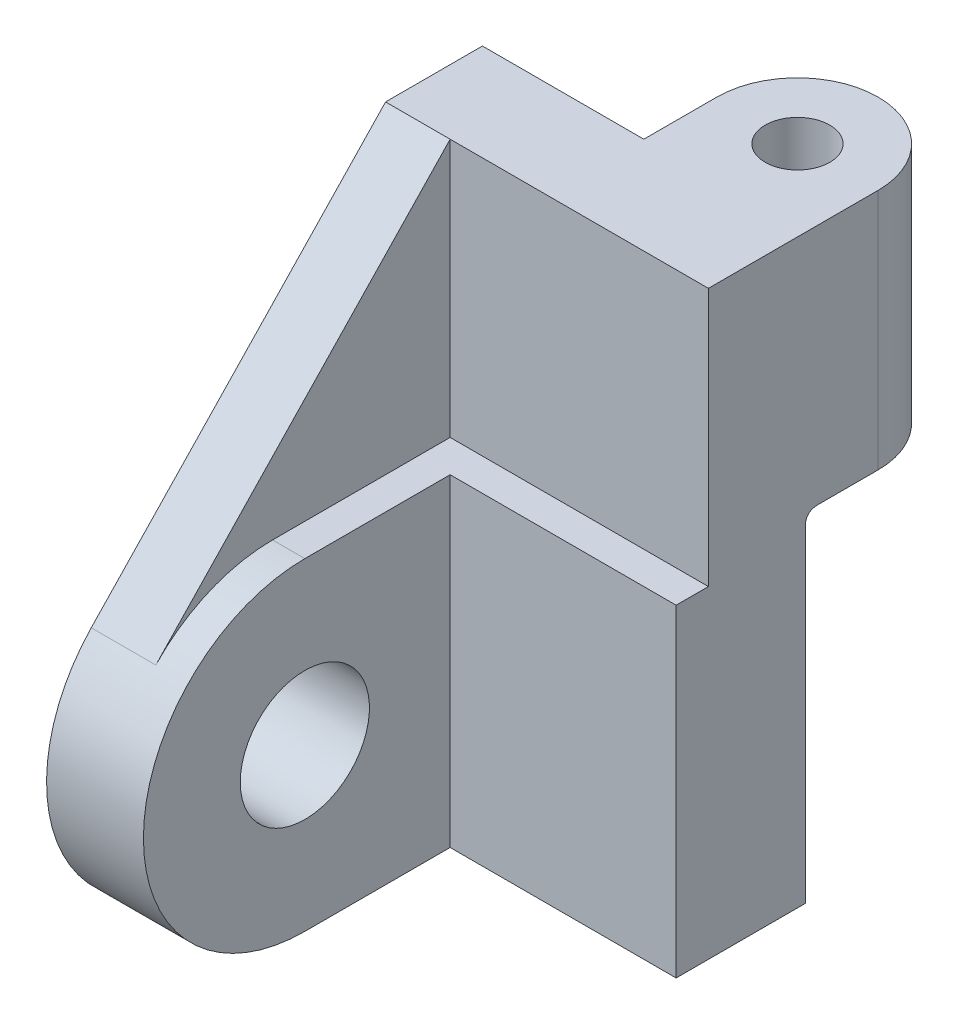
ISO-10303-21;
HEADER;
FILE_DESCRIPTION(('STEP AP214'),'2;1');
FILE_NAME('part.step','',(''),(''),'','','');
FILE_SCHEMA(('AUTOMOTIVE_DESIGN { 1 0 10303 214 1 1 1 1 }'));
ENDSEC;
DATA;
#1=APPLICATION_CONTEXT('core data for automotive mechanical design processes');
#2=APPLICATION_PROTOCOL_DEFINITION('international standard','automotive_design',2000,#1);
#3=PRODUCT_CONTEXT('',#1,'mechanical');
#4=PRODUCT('Part','Part','',(#3));
#5=PRODUCT_RELATED_PRODUCT_CATEGORY('part','',(#4));
#6=PRODUCT_DEFINITION_FORMATION('','',#4);
#7=PRODUCT_DEFINITION_CONTEXT('part definition',#1,'design');
#8=PRODUCT_DEFINITION('design','',#6,#7);
#9=PRODUCT_DEFINITION_SHAPE('','',#8);
#10=(LENGTH_UNIT() NAMED_UNIT(*) SI_UNIT(.MILLI.,.METRE.));
#11=(NAMED_UNIT(*) PLANE_ANGLE_UNIT() SI_UNIT($,.RADIAN.));
#12=(NAMED_UNIT(*) SI_UNIT($,.STERADIAN.) SOLID_ANGLE_UNIT());
#13=UNCERTAINTY_MEASURE_WITH_UNIT(LENGTH_MEASURE(1.E-05),#10,'distance_accuracy_value','');
#14=(GEOMETRIC_REPRESENTATION_CONTEXT(3) GLOBAL_UNCERTAINTY_ASSIGNED_CONTEXT((#13)) GLOBAL_UNIT_ASSIGNED_CONTEXT((#10,
#11,#12)) REPRESENTATION_CONTEXT('',''));
#15=CARTESIAN_POINT('',(0.,0.,0.));
#16=DIRECTION('',(0.,0.,1.));
#17=DIRECTION('',(1.,0.,0.));
#18=AXIS2_PLACEMENT_3D('',#15,#16,#17);
#19=CARTESIAN_POINT('',(63.5,114.3,0.));
#20=DIRECTION('',(0.,1.,0.));
#21=DIRECTION('',(0.,0.,1.));
#22=AXIS2_PLACEMENT_3D('',#19,#20,#21);
#23=PLANE('',#22);
#24=CARTESIAN_POINT('',(47.625,114.3,-14.3417082606849));
#25=DIRECTION('',(0.,1.,0.));
#26=DIRECTION('',(0.,0.,1.));
#27=AXIS2_PLACEMENT_3D('',#24,#25,#26);
#28=CIRCLE('',#27,6.35);
#29=CARTESIAN_POINT('',(47.625,114.3,-7.99170826068487));
#30=VERTEX_POINT('',#29);
#31=EDGE_CURVE('E225',#30,#30,#28,.T.);
#32=ORIENTED_EDGE('',*,*,#31,.F.);
#33=EDGE_LOOP('',(#32));
#34=FACE_BOUND('',#33,.T.);
#35=DIRECTION('',(0.,0.,-1.));
#36=VECTOR('',#35,1.);
#37=CARTESIAN_POINT('',(63.5,114.3,0.));
#38=LINE('',#37,#36);
#39=CARTESIAN_POINT('',(63.5,114.3,19.05));
#40=VERTEX_POINT('',#39);
#41=CARTESIAN_POINT('',(63.5,114.3,-14.3417082606849));
#42=VERTEX_POINT('',#41);
#43=EDGE_CURVE('E176',#40,#42,#38,.T.);
#44=ORIENTED_EDGE('',*,*,#43,.T.);
#45=CARTESIAN_POINT('',(47.625,114.3,-14.3417082606849));
#46=DIRECTION('',(0.,1.,0.));
#47=DIRECTION('',(0.,0.,1.));
#48=AXIS2_PLACEMENT_3D('',#45,#46,#47);
#49=CIRCLE('',#48,15.875);
#50=CARTESIAN_POINT('',(31.75,114.3,-14.3417082606849));
#51=VERTEX_POINT('',#50);
#52=EDGE_CURVE('E159',#42,#51,#49,.T.);
#53=ORIENTED_EDGE('',*,*,#52,.T.);
#54=DIRECTION('',(0.,0.,1.));
#55=VECTOR('',#54,1.);
#56=CARTESIAN_POINT('',(31.75,114.3,-31.75));
#57=LINE('',#56,#55);
#58=CARTESIAN_POINT('',(31.75,114.3,0.));
#59=VERTEX_POINT('',#58);
#60=EDGE_CURVE('E222',#51,#59,#57,.T.);
#61=ORIENTED_EDGE('',*,*,#60,.T.);
#62=DIRECTION('',(-1.,0.,0.));
#63=VECTOR('',#62,1.);
#64=CARTESIAN_POINT('',(63.5,114.3,0.));
#65=LINE('',#64,#63);
#66=CARTESIAN_POINT('',(0.,114.3,0.));
#67=VERTEX_POINT('',#66);
#68=EDGE_CURVE('E185',#59,#67,#65,.T.);
#69=ORIENTED_EDGE('',*,*,#68,.T.);
#70=DIRECTION('',(0.,0.,-1.));
#71=VECTOR('',#70,1.);
#72=CARTESIAN_POINT('',(0.,114.3,0.));
#73=LINE('',#72,#71);
#74=CARTESIAN_POINT('',(0.,114.3,19.05));
#75=VERTEX_POINT('',#74);
#76=EDGE_CURVE('E200',#75,#67,#73,.T.);
#77=ORIENTED_EDGE('',*,*,#76,.F.);
#78=DIRECTION('',(-1.,0.,0.));
#79=VECTOR('',#78,1.);
#80=CARTESIAN_POINT('',(12.7,114.3,19.05));
#81=LINE('',#80,#79);
#82=CARTESIAN_POINT('',(12.7,114.3,19.05));
#83=VERTEX_POINT('',#82);
#84=EDGE_CURVE('E251',#83,#75,#81,.T.);
#85=ORIENTED_EDGE('',*,*,#84,.F.);
#86=DIRECTION('',(-1.,0.,0.));
#87=VECTOR('',#86,1.);
#88=CARTESIAN_POINT('',(63.5,114.3,19.05));
#89=LINE('',#88,#87);
#90=EDGE_CURVE('E181',#40,#83,#89,.T.);
#91=ORIENTED_EDGE('',*,*,#90,.F.);
#92=EDGE_LOOP('',(#44,#53,#61,#69,#77,#85,#91));
#93=FACE_BOUND('',#92,.T.);
#94=ADVANCED_FACE('F55',(#34,#93),#23,.T.);
#95=CARTESIAN_POINT('',(63.5,0.,0.));
#96=DIRECTION('',(1.,0.,0.));
#97=DIRECTION('',(0.,0.,-1.));
#98=AXIS2_PLACEMENT_3D('',#95,#96,#97);
#99=PLANE('',#98);
#100=DIRECTION('',(0.,0.,1.));
#101=VECTOR('',#100,1.);
#102=CARTESIAN_POINT('',(63.5,66.675,-31.75));
#103=LINE('',#102,#101);
#104=CARTESIAN_POINT('',(63.5,66.675,-14.3417082606849));
#105=VERTEX_POINT('',#104);
#106=CARTESIAN_POINT('',(63.5,66.675,-2.54));
#107=VERTEX_POINT('',#106);
#108=EDGE_CURVE('E178',#105,#107,#103,.T.);
#109=ORIENTED_EDGE('',*,*,#108,.F.);
#110=DIRECTION('',(0.,1.,0.));
#111=VECTOR('',#110,1.);
#112=CARTESIAN_POINT('',(63.5,-5.00000000014378E-05,-14.3417082606849));
#113=LINE('',#112,#111);
#114=EDGE_CURVE('E162',#105,#42,#113,.T.);
#115=ORIENTED_EDGE('',*,*,#114,.T.);
#116=ORIENTED_EDGE('',*,*,#43,.F.);
#117=DIRECTION('',(0.,1.,0.));
#118=VECTOR('',#117,1.);
#119=CARTESIAN_POINT('',(63.5,0.,19.05));
#120=LINE('',#119,#118);
#121=CARTESIAN_POINT('',(63.5,63.5,19.05));
#122=VERTEX_POINT('',#121);
#123=EDGE_CURVE('E202',#122,#40,#120,.T.);
#124=ORIENTED_EDGE('',*,*,#123,.F.);
#125=DIRECTION('',(0.,0.,-1.));
#126=VECTOR('',#125,1.);
#127=CARTESIAN_POINT('',(63.5,63.5,0.));
#128=LINE('',#127,#126);
#129=CARTESIAN_POINT('',(63.5,63.5,25.4));
#130=VERTEX_POINT('',#129);
#131=EDGE_CURVE('E417',#130,#122,#128,.T.);
#132=ORIENTED_EDGE('',*,*,#131,.F.);
#133=DIRECTION('',(0.,1.,0.));
#134=VECTOR('',#133,1.);
#135=CARTESIAN_POINT('',(63.5,0.,25.4));
#136=LINE('',#135,#134);
#137=CARTESIAN_POINT('',(63.5,0.,25.4));
#138=VERTEX_POINT('',#137);
#139=EDGE_CURVE('E419',#138,#130,#136,.T.);
#140=ORIENTED_EDGE('',*,*,#139,.F.);
#141=DIRECTION('',(0.,0.,1.));
#142=VECTOR('',#141,1.);
#143=CARTESIAN_POINT('',(63.5,0.,0.));
#144=LINE('',#143,#142);
#145=CARTESIAN_POINT('',(63.5,0.,0.));
#146=VERTEX_POINT('',#145);
#147=EDGE_CURVE('E187',#146,#138,#144,.T.);
#148=ORIENTED_EDGE('',*,*,#147,.F.);
#149=DIRECTION('',(0.,1.,0.));
#150=VECTOR('',#149,1.);
#151=CARTESIAN_POINT('',(63.5,0.,0.));
#152=LINE('',#151,#150);
#153=CARTESIAN_POINT('',(63.5,64.135,0.));
#154=VERTEX_POINT('',#153);
#155=EDGE_CURVE('E183',#146,#154,#152,.T.);
#156=ORIENTED_EDGE('',*,*,#155,.T.);
#157=CARTESIAN_POINT('',(63.5,66.675,-2.54));
#158=CARTESIAN_POINT('',(63.5,66.675,0.));
#159=CARTESIAN_POINT('',(63.5,64.135,0.));
#160=(BOUNDED_CURVE() B_SPLINE_CURVE(2,(#157,#158,#159),.UNSPECIFIED.,.F.,
.F.) B_SPLINE_CURVE_WITH_KNOTS((3,3),(0.,1.),
.UNSPECIFIED.) CURVE() GEOMETRIC_REPRESENTATION_ITEM() RATIONAL_B_SPLINE_CURVE((1.,1.,1.)) REPRESENTATION_ITEM(''));
#161=EDGE_CURVE('E13',#154,#107,#160,.F.);
#162=ORIENTED_EDGE('',*,*,#161,.T.);
#163=EDGE_LOOP('',(#109,#115,#116,#124,#132,#140,#148,#156,#162));
#164=FACE_BOUND('',#163,.T.);
#165=ADVANCED_FACE('F174',(#164),#99,.T.);
#166=CARTESIAN_POINT('',(63.5,66.675,-31.75));
#167=DIRECTION('',(0.,1.,0.));
#168=DIRECTION('',(0.,0.,1.));
#169=AXIS2_PLACEMENT_3D('',#166,#167,#168);
#170=PLANE('',#169);
#171=CARTESIAN_POINT('',(47.625,66.675,-14.3417082606849));
#172=DIRECTION('',(0.,1.,0.));
#173=DIRECTION('',(0.,0.,1.));
#174=AXIS2_PLACEMENT_3D('',#171,#172,#173);
#175=CIRCLE('',#174,6.35);
#176=CARTESIAN_POINT('',(47.625,66.675,-7.99170826068487));
#177=VERTEX_POINT('',#176);
#178=EDGE_CURVE('E169',#177,#177,#175,.T.);
#179=ORIENTED_EDGE('',*,*,#178,.T.);
#180=EDGE_LOOP('',(#179));
#181=FACE_BOUND('',#180,.T.);
#182=ORIENTED_EDGE('',*,*,#108,.T.);
#183=CARTESIAN_POINT('',(30.1625,66.675,-2.54));
#184=CARTESIAN_POINT('',(41.8041666666666,66.675,-2.54));
#185=CARTESIAN_POINT('',(53.4458333333334,66.675,-2.54));
#186=CARTESIAN_POINT('',(65.0875,66.675,-2.54));
#187=(BOUNDED_CURVE() B_SPLINE_CURVE(3,(#183,#184,#185,#186),.UNSPECIFIED.,.F.,
.F.) B_SPLINE_CURVE_WITH_KNOTS((4,4),(-0.0333375,0.0015875),
.UNSPECIFIED.) CURVE() GEOMETRIC_REPRESENTATION_ITEM() RATIONAL_B_SPLINE_CURVE((1.,1.,1.,1.)) REPRESENTATION_ITEM(''));
#188=CARTESIAN_POINT('',(31.75,66.675,-2.54));
#189=VERTEX_POINT('',#188);
#190=EDGE_CURVE('E301',#107,#189,#187,.F.);
#191=ORIENTED_EDGE('',*,*,#190,.T.);
#192=DIRECTION('',(0.,0.,1.));
#193=VECTOR('',#192,1.);
#194=CARTESIAN_POINT('',(31.75,66.675,-31.75));
#195=LINE('',#194,#193);
#196=CARTESIAN_POINT('',(31.75,66.675,-14.3417082606849));
#197=VERTEX_POINT('',#196);
#198=EDGE_CURVE('E221',#197,#189,#195,.T.);
#199=ORIENTED_EDGE('',*,*,#198,.F.);
#200=CARTESIAN_POINT('',(47.625,66.675,-14.3417082606849));
#201=DIRECTION('',(0.,1.,0.));
#202=DIRECTION('',(0.,0.,1.));
#203=AXIS2_PLACEMENT_3D('',#200,#201,#202);
#204=CIRCLE('',#203,15.875);
#205=EDGE_CURVE('E431',#105,#197,#204,.T.);
#206=ORIENTED_EDGE('',*,*,#205,.F.);
#207=EDGE_LOOP('',(#182,#191,#199,#206));
#208=FACE_BOUND('',#207,.T.);
#209=ADVANCED_FACE('F355',(#181,#208),#170,.F.);
#210=CARTESIAN_POINT('',(31.75,66.675,-31.75));
#211=DIRECTION('',(1.,0.,0.));
#212=DIRECTION('',(0.,0.,-1.));
#213=AXIS2_PLACEMENT_3D('',#210,#211,#212);
#214=PLANE('',#213);
#215=DIRECTION('',(0.,1.,0.));
#216=VECTOR('',#215,1.);
#217=CARTESIAN_POINT('',(31.75,-5.00000000014378E-05,-14.3417082606849));
#218=LINE('',#217,#216);
#219=EDGE_CURVE('E165',#197,#51,#218,.T.);
#220=ORIENTED_EDGE('',*,*,#219,.F.);
#221=ORIENTED_EDGE('',*,*,#198,.T.);
#222=CARTESIAN_POINT('',(31.75,64.135,0.));
#223=CARTESIAN_POINT('',(31.75,66.675,0.));
#224=CARTESIAN_POINT('',(31.75,66.675,-2.54));
#225=(BOUNDED_CURVE() B_SPLINE_CURVE(2,(#222,#223,#224),.UNSPECIFIED.,.F.,
.F.) B_SPLINE_CURVE_WITH_KNOTS((3,3),(0.,1.),
.UNSPECIFIED.) CURVE() GEOMETRIC_REPRESENTATION_ITEM() RATIONAL_B_SPLINE_CURVE((1.,1.,1.)) REPRESENTATION_ITEM(''));
#226=CARTESIAN_POINT('',(31.75,64.135,0.));
#227=VERTEX_POINT('',#226);
#228=EDGE_CURVE('E69',#189,#227,#225,.F.);
#229=ORIENTED_EDGE('',*,*,#228,.T.);
#230=DIRECTION('',(0.,1.,0.));
#231=VECTOR('',#230,1.);
#232=CARTESIAN_POINT('',(31.75,66.675,0.));
#233=LINE('',#232,#231);
#234=EDGE_CURVE('E76',#227,#59,#233,.T.);
#235=ORIENTED_EDGE('',*,*,#234,.T.);
#236=ORIENTED_EDGE('',*,*,#60,.F.);
#237=EDGE_LOOP('',(#220,#221,#229,#235,#236));
#238=FACE_BOUND('',#237,.T.);
#239=ADVANCED_FACE('F309',(#238),#214,.F.);
#240=CARTESIAN_POINT('',(63.5,0.,0.));
#241=DIRECTION('',(0.,0.,1.));
#242=DIRECTION('',(1.,0.,0.));
#243=AXIS2_PLACEMENT_3D('',#240,#241,#242);
#244=PLANE('',#243);
#245=ORIENTED_EDGE('',*,*,#234,.F.);
#246=CARTESIAN_POINT('',(65.0875,64.135,0.));
#247=CARTESIAN_POINT('',(53.4458333333334,64.135,0.));
#248=CARTESIAN_POINT('',(41.8041666666666,64.135,0.));
#249=CARTESIAN_POINT('',(30.1625,64.135,0.));
#250=(BOUNDED_CURVE() B_SPLINE_CURVE(3,(#246,#247,#248,#249),.UNSPECIFIED.,.F.,
.F.) B_SPLINE_CURVE_WITH_KNOTS((4,4),(-0.0333375,0.0015875),
.UNSPECIFIED.) CURVE() GEOMETRIC_REPRESENTATION_ITEM() RATIONAL_B_SPLINE_CURVE((1.,1.,1.,1.)) REPRESENTATION_ITEM(''));
#251=EDGE_CURVE('E81',#227,#154,#250,.F.);
#252=ORIENTED_EDGE('',*,*,#251,.T.);
#253=ORIENTED_EDGE('',*,*,#155,.F.);
#254=DIRECTION('',(-1.,0.,0.));
#255=VECTOR('',#254,1.);
#256=CARTESIAN_POINT('',(63.5,0.,0.));
#257=LINE('',#256,#255);
#258=CARTESIAN_POINT('',(0.,0.,0.));
#259=VERTEX_POINT('',#258);
#260=EDGE_CURVE('E206',#146,#259,#257,.T.);
#261=ORIENTED_EDGE('',*,*,#260,.T.);
#262=DIRECTION('',(0.,1.,0.));
#263=VECTOR('',#262,1.);
#264=CARTESIAN_POINT('',(0.,0.,0.));
#265=LINE('',#264,#263);
#266=EDGE_CURVE('E196',#259,#67,#265,.T.);
#267=ORIENTED_EDGE('',*,*,#266,.T.);
#268=ORIENTED_EDGE('',*,*,#68,.F.);
#269=EDGE_LOOP('',(#245,#252,#253,#261,#267,#268));
#270=FACE_BOUND('',#269,.T.);
#271=ADVANCED_FACE('F366',(#270),#244,.F.);
#272=CARTESIAN_POINT('',(63.5,0.,19.05));
#273=DIRECTION('',(0.,0.,1.));
#274=DIRECTION('',(1.,0.,0.));
#275=AXIS2_PLACEMENT_3D('',#272,#273,#274);
#276=PLANE('',#275);
#277=DIRECTION('',(0.,1.,0.));
#278=VECTOR('',#277,1.);
#279=CARTESIAN_POINT('',(12.7,0.,19.05));
#280=LINE('',#279,#278);
#281=CARTESIAN_POINT('',(12.7,63.5,19.05));
#282=VERTEX_POINT('',#281);
#283=EDGE_CURVE('E240',#282,#83,#280,.T.);
#284=ORIENTED_EDGE('',*,*,#283,.F.);
#285=DIRECTION('',(-1.,0.,0.));
#286=VECTOR('',#285,1.);
#287=CARTESIAN_POINT('',(63.5,63.5,19.05));
#288=LINE('',#287,#286);
#289=EDGE_CURVE('E296',#122,#282,#288,.T.);
#290=ORIENTED_EDGE('',*,*,#289,.F.);
#291=ORIENTED_EDGE('',*,*,#123,.T.);
#292=ORIENTED_EDGE('',*,*,#90,.T.);
#293=EDGE_LOOP('',(#284,#290,#291,#292));
#294=FACE_BOUND('',#293,.T.);
#295=ADVANCED_FACE('F370',(#294),#276,.T.);
#296=CARTESIAN_POINT('',(63.5,63.5,0.));
#297=DIRECTION('',(0.,1.,0.));
#298=DIRECTION('',(0.,0.,1.));
#299=AXIS2_PLACEMENT_3D('',#296,#297,#298);
#300=PLANE('',#299);
#301=DIRECTION('',(0.,0.,-1.));
#302=VECTOR('',#301,1.);
#303=CARTESIAN_POINT('',(12.7,63.5,0.));
#304=LINE('',#303,#302);
#305=CARTESIAN_POINT('',(12.7,63.5,53.975));
#306=VERTEX_POINT('',#305);
#307=EDGE_CURVE('E237',#306,#282,#304,.T.);
#308=ORIENTED_EDGE('',*,*,#307,.F.);
#309=DIRECTION('',(-1.,0.,0.));
#310=VECTOR('',#309,1.);
#311=CARTESIAN_POINT('',(19.05,63.5,53.975));
#312=LINE('',#311,#310);
#313=CARTESIAN_POINT('',(19.05,63.5,53.975));
#314=VERTEX_POINT('',#313);
#315=EDGE_CURVE('E197',#314,#306,#312,.T.);
#316=ORIENTED_EDGE('',*,*,#315,.F.);
#317=DIRECTION('',(0.,0.,-1.));
#318=VECTOR('',#317,1.);
#319=CARTESIAN_POINT('',(19.05,63.5,0.));
#320=LINE('',#319,#318);
#321=CARTESIAN_POINT('',(19.05,63.5,25.4));
#322=VERTEX_POINT('',#321);
#323=EDGE_CURVE('E258',#314,#322,#320,.T.);
#324=ORIENTED_EDGE('',*,*,#323,.T.);
#325=DIRECTION('',(-1.,0.,0.));
#326=VECTOR('',#325,1.);
#327=CARTESIAN_POINT('',(63.5,63.5,25.4));
#328=LINE('',#327,#326);
#329=EDGE_CURVE('E273',#130,#322,#328,.T.);
#330=ORIENTED_EDGE('',*,*,#329,.F.);
#331=ORIENTED_EDGE('',*,*,#131,.T.);
#332=ORIENTED_EDGE('',*,*,#289,.T.);
#333=EDGE_LOOP('',(#308,#316,#324,#330,#331,#332));
#334=FACE_BOUND('',#333,.T.);
#335=ADVANCED_FACE('F425',(#334),#300,.T.);
#336=CARTESIAN_POINT('',(63.5,0.,25.4));
#337=DIRECTION('',(0.,0.,1.));
#338=DIRECTION('',(1.,0.,0.));
#339=AXIS2_PLACEMENT_3D('',#336,#337,#338);
#340=PLANE('',#339);
#341=DIRECTION('',(0.,1.,0.));
#342=VECTOR('',#341,1.);
#343=CARTESIAN_POINT('',(19.05,0.,25.4));
#344=LINE('',#343,#342);
#345=CARTESIAN_POINT('',(19.05,0.,25.4));
#346=VERTEX_POINT('',#345);
#347=EDGE_CURVE('E268',#346,#322,#344,.T.);
#348=ORIENTED_EDGE('',*,*,#347,.F.);
#349=DIRECTION('',(-1.,0.,0.));
#350=VECTOR('',#349,1.);
#351=CARTESIAN_POINT('',(63.5,0.,25.4));
#352=LINE('',#351,#350);
#353=EDGE_CURVE('E291',#138,#346,#352,.T.);
#354=ORIENTED_EDGE('',*,*,#353,.F.);
#355=ORIENTED_EDGE('',*,*,#139,.T.);
#356=ORIENTED_EDGE('',*,*,#329,.T.);
#357=EDGE_LOOP('',(#348,#354,#355,#356));
#358=FACE_BOUND('',#357,.T.);
#359=ADVANCED_FACE('F424',(#358),#340,.T.);
#360=CARTESIAN_POINT('',(63.5,0.,0.));
#361=DIRECTION('',(0.,-1.,0.));
#362=DIRECTION('',(0.,0.,-1.));
#363=AXIS2_PLACEMENT_3D('',#360,#361,#362);
#364=PLANE('',#363);
#365=DIRECTION('',(0.,0.,1.));
#366=VECTOR('',#365,1.);
#367=CARTESIAN_POINT('',(0.,0.,0.));
#368=LINE('',#367,#366);
#369=CARTESIAN_POINT('',(0.,0.,53.975));
#370=VERTEX_POINT('',#369);
#371=EDGE_CURVE('E193',#259,#370,#368,.T.);
#372=ORIENTED_EDGE('',*,*,#371,.F.);
#373=ORIENTED_EDGE('',*,*,#260,.F.);
#374=ORIENTED_EDGE('',*,*,#147,.T.);
#375=ORIENTED_EDGE('',*,*,#353,.T.);
#376=DIRECTION('',(0.,0.,-1.));
#377=VECTOR('',#376,1.);
#378=CARTESIAN_POINT('',(19.05,0.,0.));
#379=LINE('',#378,#377);
#380=CARTESIAN_POINT('',(19.05,0.,53.975));
#381=VERTEX_POINT('',#380);
#382=EDGE_CURVE('E263',#381,#346,#379,.T.);
#383=ORIENTED_EDGE('',*,*,#382,.F.);
#384=DIRECTION('',(-1.,0.,0.));
#385=VECTOR('',#384,1.);
#386=CARTESIAN_POINT('',(19.05,0.,53.975));
#387=LINE('',#386,#385);
#388=EDGE_CURVE('E272',#381,#370,#387,.T.);
#389=ORIENTED_EDGE('',*,*,#388,.T.);
#390=EDGE_LOOP('',(#372,#373,#374,#375,#383,#389));
#391=FACE_BOUND('',#390,.T.);
#392=ADVANCED_FACE('F289',(#391),#364,.T.);
#393=CARTESIAN_POINT('',(0.,0.,0.));
#394=DIRECTION('',(1.,0.,0.));
#395=DIRECTION('',(0.,0.,-1.));
#396=AXIS2_PLACEMENT_3D('',#393,#394,#395);
#397=PLANE('',#396);
#398=DIRECTION('',(0.,0.723236758704005,-0.690600167144003));
#399=VECTOR('',#398,1.);
#400=CARTESIAN_POINT('',(0.,64.0277924090109,67.0536371868703));
#401=LINE('',#400,#399);
#402=CARTESIAN_POINT('',(0.,53.6765553068221,76.9377670888522));
#403=VERTEX_POINT('',#402);
#404=EDGE_CURVE('E220',#403,#75,#401,.T.);
#405=ORIENTED_EDGE('',*,*,#404,.T.);
#406=ORIENTED_EDGE('',*,*,#76,.T.);
#407=ORIENTED_EDGE('',*,*,#266,.F.);
#408=ORIENTED_EDGE('',*,*,#371,.T.);
#409=CARTESIAN_POINT('',(0.,31.75,53.975));
#410=DIRECTION('',(1.,0.,0.));
#411=DIRECTION('',(0.,0.,-1.));
#412=AXIS2_PLACEMENT_3D('',#409,#410,#411);
#413=CIRCLE('',#412,31.75);
#414=EDGE_CURVE('E259',#403,#370,#413,.T.);
#415=ORIENTED_EDGE('',*,*,#414,.F.);
#416=EDGE_LOOP('',(#405,#406,#407,#408,#415));
#417=FACE_BOUND('',#416,.T.);
#418=CARTESIAN_POINT('',(0.,31.75,53.975));
#419=DIRECTION('',(1.,0.,0.));
#420=DIRECTION('',(0.,0.,-1.));
#421=AXIS2_PLACEMENT_3D('',#418,#419,#420);
#422=CIRCLE('',#421,12.7);
#423=CARTESIAN_POINT('',(0.,31.75,66.675));
#424=VERTEX_POINT('',#423);
#425=EDGE_CURVE('E254',#424,#424,#422,.T.);
#426=ORIENTED_EDGE('',*,*,#425,.T.);
#427=EDGE_LOOP('',(#426));
#428=FACE_BOUND('',#427,.T.);
#429=ADVANCED_FACE('F358',(#417,#428),#397,.F.);
#430=CARTESIAN_POINT('',(19.05,31.75,53.975));
#431=DIRECTION('',(-1.,0.,0.));
#432=DIRECTION('',(0.,0.,1.));
#433=AXIS2_PLACEMENT_3D('',#430,#431,#432);
#434=CYLINDRICAL_SURFACE('',#433,31.75);
#435=CARTESIAN_POINT('',(12.7,31.75,53.975));
#436=DIRECTION('',(1.,0.,0.));
#437=DIRECTION('',(0.,0.,-1.));
#438=AXIS2_PLACEMENT_3D('',#435,#436,#437);
#439=CIRCLE('',#438,31.75);
#440=CARTESIAN_POINT('',(12.7,53.6765553068221,76.9377670888522));
#441=VERTEX_POINT('',#440);
#442=EDGE_CURVE('E235',#306,#441,#439,.T.);
#443=ORIENTED_EDGE('',*,*,#442,.T.);
#444=DIRECTION('',(-1.,0.,0.));
#445=VECTOR('',#444,1.);
#446=CARTESIAN_POINT('',(12.7,53.6765553068221,76.9377670888522));
#447=LINE('',#446,#445);
#448=EDGE_CURVE('E246',#441,#403,#447,.T.);
#449=ORIENTED_EDGE('',*,*,#448,.T.);
#450=ORIENTED_EDGE('',*,*,#414,.T.);
#451=ORIENTED_EDGE('',*,*,#388,.F.);
#452=CARTESIAN_POINT('',(19.05,31.75,53.975));
#453=DIRECTION('',(1.,0.,0.));
#454=DIRECTION('',(0.,0.,-1.));
#455=AXIS2_PLACEMENT_3D('',#452,#453,#454);
#456=CIRCLE('',#455,31.75);
#457=EDGE_CURVE('E260',#314,#381,#456,.T.);
#458=ORIENTED_EDGE('',*,*,#457,.F.);
#459=ORIENTED_EDGE('',*,*,#315,.T.);
#460=EDGE_LOOP('',(#443,#449,#450,#451,#458,#459));
#461=FACE_BOUND('',#460,.T.);
#462=ADVANCED_FACE('F361',(#461),#434,.T.);
#463=CARTESIAN_POINT('',(19.05,31.75,53.975));
#464=DIRECTION('',(-1.,0.,0.));
#465=DIRECTION('',(0.,0.,1.));
#466=AXIS2_PLACEMENT_3D('',#463,#464,#465);
#467=CYLINDRICAL_SURFACE('',#466,12.7);
#468=CARTESIAN_POINT('',(19.05,31.75,53.975));
#469=DIRECTION('',(1.,0.,0.));
#470=DIRECTION('',(0.,0.,-1.));
#471=AXIS2_PLACEMENT_3D('',#468,#469,#470);
#472=CIRCLE('',#471,12.7);
#473=CARTESIAN_POINT('',(19.05,31.75,66.675));
#474=VERTEX_POINT('',#473);
#475=EDGE_CURVE('E255',#474,#474,#472,.T.);
#476=CARTESIAN_POINT('',(19.05,31.75,66.675));
#477=CARTESIAN_POINT('',(18.8515625,31.75,66.675));
#478=CARTESIAN_POINT('',(18.653125,31.75,66.675));
#479=CARTESIAN_POINT('',(18.25625,31.75,66.675));
#480=CARTESIAN_POINT('',(18.0578125,31.75,66.675));
#481=CARTESIAN_POINT('',(17.6609375,31.75,66.675));
#482=CARTESIAN_POINT('',(17.4625,31.75,66.675));
#483=CARTESIAN_POINT('',(17.065625,31.75,66.675));
#484=CARTESIAN_POINT('',(16.8671875,31.75,66.675));
#485=CARTESIAN_POINT('',(16.4703125,31.75,66.675));
#486=CARTESIAN_POINT('',(16.271875,31.75,66.675));
#487=CARTESIAN_POINT('',(15.875,31.75,66.675));
#488=CARTESIAN_POINT('',(15.6765625,31.75,66.675));
#489=CARTESIAN_POINT('',(15.2796875,31.75,66.675));
#490=CARTESIAN_POINT('',(15.08125,31.75,66.675));
#491=CARTESIAN_POINT('',(14.684375,31.75,66.675));
#492=CARTESIAN_POINT('',(14.4859375,31.75,66.675));
#493=CARTESIAN_POINT('',(14.0890625,31.75,66.675));
#494=CARTESIAN_POINT('',(13.890625,31.75,66.675));
#495=CARTESIAN_POINT('',(13.49375,31.75,66.675));
#496=CARTESIAN_POINT('',(13.2953125,31.75,66.675));
#497=CARTESIAN_POINT('',(12.8984375,31.75,66.675));
#498=CARTESIAN_POINT('',(12.7,31.75,66.675));
#499=CARTESIAN_POINT('',(12.303125,31.75,66.675));
#500=CARTESIAN_POINT('',(12.1046875,31.75,66.675));
#501=CARTESIAN_POINT('',(11.7078125,31.75,66.675));
#502=CARTESIAN_POINT('',(11.509375,31.75,66.675));
#503=CARTESIAN_POINT('',(11.1125,31.75,66.675));
#504=CARTESIAN_POINT('',(10.9140625,31.75,66.675));
#505=CARTESIAN_POINT('',(10.5171875,31.75,66.675));
#506=CARTESIAN_POINT('',(10.31875,31.75,66.675));
#507=CARTESIAN_POINT('',(9.921875,31.75,66.675));
#508=CARTESIAN_POINT('',(9.7234375,31.75,66.675));
#509=CARTESIAN_POINT('',(9.3265625,31.75,66.675));
#510=CARTESIAN_POINT('',(9.128125,31.75,66.675));
#511=CARTESIAN_POINT('',(8.73125,31.75,66.675));
#512=CARTESIAN_POINT('',(8.5328125,31.75,66.675));
#513=CARTESIAN_POINT('',(8.1359375,31.75,66.675));
#514=CARTESIAN_POINT('',(7.9375,31.75,66.675));
#515=CARTESIAN_POINT('',(7.540625,31.75,66.675));
#516=CARTESIAN_POINT('',(7.3421875,31.75,66.675));
#517=CARTESIAN_POINT('',(6.9453125,31.75,66.675));
#518=CARTESIAN_POINT('',(6.746875,31.75,66.675));
#519=CARTESIAN_POINT('',(6.35,31.75,66.675));
#520=CARTESIAN_POINT('',(6.1515625,31.75,66.675));
#521=CARTESIAN_POINT('',(5.7546875,31.75,66.675));
#522=CARTESIAN_POINT('',(5.55625,31.75,66.675));
#523=CARTESIAN_POINT('',(5.159375,31.75,66.675));
#524=CARTESIAN_POINT('',(4.9609375,31.75,66.675));
#525=CARTESIAN_POINT('',(4.5640625,31.75,66.675));
#526=CARTESIAN_POINT('',(4.365625,31.75,66.675));
#527=CARTESIAN_POINT('',(3.96875,31.75,66.675));
#528=CARTESIAN_POINT('',(3.7703125,31.75,66.675));
#529=CARTESIAN_POINT('',(3.3734375,31.75,66.675));
#530=CARTESIAN_POINT('',(3.175,31.75,66.675));
#531=CARTESIAN_POINT('',(2.778125,31.75,66.675));
#532=CARTESIAN_POINT('',(2.5796875,31.75,66.675));
#533=CARTESIAN_POINT('',(2.1828125,31.75,66.675));
#534=CARTESIAN_POINT('',(1.984375,31.75,66.675));
#535=CARTESIAN_POINT('',(1.5875,31.75,66.675));
#536=CARTESIAN_POINT('',(1.3890625,31.75,66.675));
#537=CARTESIAN_POINT('',(0.992187500000001,31.75,66.675));
#538=CARTESIAN_POINT('',(0.793750000000001,31.75,66.675));
#539=CARTESIAN_POINT('',(0.396875,31.75,66.675));
#540=CARTESIAN_POINT('',(0.1984375,31.75,66.675));
#541=CARTESIAN_POINT('',(0.,31.75,66.675));
#542=B_SPLINE_CURVE_WITH_KNOTS('',3,(#476,#477,#478,#479,#480,#481,#482,#483,#484,#485,#486,
#487,#488,#489,#490,#491,#492,#493,#494,#495,#496,#497,#498,#499,#500,#501,#502,#503,#504,#505,
#506,#507,#508,#509,#510,#511,#512,#513,#514,#515,#516,#517,#518,#519,#520,#521,#522,#523,#524,
#525,#526,#527,#528,#529,#530,#531,#532,#533,#534,#535,#536,#537,#538,#539,#540,#541),
.UNSPECIFIED.,.F.,.F.,(4,2,2,2,2,2,2,2,2,2,2,2,2,2,2,2,2,2,2,2,2,2,2,2,2,2,2,2,2,2,2,2,4),(0.,
0.595312499999997,1.190625,1.7859375,2.38125,2.9765625,3.571875,4.1671875,4.7625,5.3578125,
5.953125,6.5484375,7.14375,7.7390625,8.334375,8.9296875,9.525,10.1203125,10.715625,11.3109375,
11.90625,12.5015625,13.096875,13.6921875,14.2875,14.8828125,15.478125,16.0734375,16.66875,
17.2640625,17.859375,18.4546875,19.05),.UNSPECIFIED.);
#543=EDGE_CURVE('BSEAM356',#474,#424,#542,.T.);
#544=ORIENTED_EDGE('',*,*,#475,.T.);
#545=ORIENTED_EDGE('',*,*,#425,.F.);
#546=ORIENTED_EDGE('',*,*,#543,.T.);
#547=ORIENTED_EDGE('',*,*,#543,.F.);
#548=EDGE_LOOP('',(#544,#546,#545,#547));
#549=FACE_BOUND('',#548,.T.);
#550=ADVANCED_FACE('F356',(#549),#467,.F.);
#551=CARTESIAN_POINT('',(19.05,0.,0.));
#552=DIRECTION('',(1.,0.,0.));
#553=DIRECTION('',(0.,0.,-1.));
#554=AXIS2_PLACEMENT_3D('',#551,#552,#553);
#555=PLANE('',#554);
#556=ORIENTED_EDGE('',*,*,#475,.F.);
#557=EDGE_LOOP('',(#556));
#558=FACE_BOUND('',#557,.T.);
#559=ORIENTED_EDGE('',*,*,#323,.F.);
#560=ORIENTED_EDGE('',*,*,#457,.T.);
#561=ORIENTED_EDGE('',*,*,#382,.T.);
#562=ORIENTED_EDGE('',*,*,#347,.T.);
#563=EDGE_LOOP('',(#559,#560,#561,#562));
#564=FACE_BOUND('',#563,.T.);
#565=ADVANCED_FACE('F282',(#558,#564),#555,.T.);
#566=CARTESIAN_POINT('',(12.7,64.0277924090109,67.0536371868703));
#567=DIRECTION('',(0.,0.690600167144003,0.723236758704005));
#568=DIRECTION('',(0.,-0.723236758704005,0.690600167144003));
#569=AXIS2_PLACEMENT_3D('',#566,#567,#568);
#570=PLANE('',#569);
#571=ORIENTED_EDGE('',*,*,#404,.F.);
#572=ORIENTED_EDGE('',*,*,#448,.F.);
#573=DIRECTION('',(0.,0.723236758704005,-0.690600167144003));
#574=VECTOR('',#573,1.);
#575=CARTESIAN_POINT('',(12.7,64.0277924090109,67.0536371868703));
#576=LINE('',#575,#574);
#577=EDGE_CURVE('E243',#441,#83,#576,.T.);
#578=ORIENTED_EDGE('',*,*,#577,.T.);
#579=ORIENTED_EDGE('',*,*,#84,.T.);
#580=EDGE_LOOP('',(#571,#572,#578,#579));
#581=FACE_BOUND('',#580,.T.);
#582=ADVANCED_FACE('F397',(#581),#570,.T.);
#583=CARTESIAN_POINT('',(12.7,0.,0.));
#584=DIRECTION('',(1.,0.,0.));
#585=DIRECTION('',(0.,0.,-1.));
#586=AXIS2_PLACEMENT_3D('',#583,#584,#585);
#587=PLANE('',#586);
#588=ORIENTED_EDGE('',*,*,#442,.F.);
#589=ORIENTED_EDGE('',*,*,#307,.T.);
#590=ORIENTED_EDGE('',*,*,#283,.T.);
#591=ORIENTED_EDGE('',*,*,#577,.F.);
#592=EDGE_LOOP('',(#588,#589,#590,#591));
#593=FACE_BOUND('',#592,.T.);
#594=ADVANCED_FACE('F394',(#593),#587,.T.);
#595=CARTESIAN_POINT('',(47.625,-5.00000000014378E-05,-14.3417082606849));
#596=DIRECTION('',(0.,1.,0.));
#597=DIRECTION('',(0.,0.,1.));
#598=AXIS2_PLACEMENT_3D('',#595,#596,#597);
#599=CYLINDRICAL_SURFACE('',#598,15.875);
#600=ORIENTED_EDGE('',*,*,#205,.T.);
#601=ORIENTED_EDGE('',*,*,#219,.T.);
#602=ORIENTED_EDGE('',*,*,#52,.F.);
#603=ORIENTED_EDGE('',*,*,#114,.F.);
#604=EDGE_LOOP('',(#600,#601,#602,#603));
#605=FACE_BOUND('',#604,.T.);
#606=ADVANCED_FACE('F161',(#605),#599,.T.);
#607=CARTESIAN_POINT('',(47.625,-5.00000000014378E-05,-14.3417082606849));
#608=DIRECTION('',(0.,1.,0.));
#609=DIRECTION('',(0.,0.,1.));
#610=AXIS2_PLACEMENT_3D('',#607,#608,#609);
#611=CYLINDRICAL_SURFACE('',#610,6.35);
#612=ORIENTED_EDGE('',*,*,#31,.T.);
#613=EDGE_LOOP('',(#612));
#614=FACE_BOUND('',#613,.T.);
#615=ORIENTED_EDGE('',*,*,#178,.F.);
#616=EDGE_LOOP('',(#615));
#617=FACE_BOUND('',#616,.T.);
#618=ADVANCED_FACE('F437',(#614,#617),#611,.F.);
#619=CARTESIAN_POINT('',(30.1625,64.135,0.));
#620=CARTESIAN_POINT('',(41.8041666666666,64.135,0.));
#621=CARTESIAN_POINT('',(53.4458333333334,64.135,0.));
#622=CARTESIAN_POINT('',(65.0875,64.135,0.));
#623=CARTESIAN_POINT('',(30.1625,66.675,0.));
#624=CARTESIAN_POINT('',(41.8041666666666,66.675,0.));
#625=CARTESIAN_POINT('',(53.4458333333334,66.675,0.));
#626=CARTESIAN_POINT('',(65.0875,66.675,0.));
#627=CARTESIAN_POINT('',(30.1625,66.675,-2.54));
#628=CARTESIAN_POINT('',(41.8041666666666,66.675,-2.54));
#629=CARTESIAN_POINT('',(53.4458333333334,66.675,-2.54));
#630=CARTESIAN_POINT('',(65.0875,66.675,-2.54));
#631=(BOUNDED_SURFACE() B_SPLINE_SURFACE(2,3,((#619,#620,#621,#622),(#623,#624,#625,#626),(#627,
#628,#629,#630)),.UNSPECIFIED.,.F.,.F.,.F.) B_SPLINE_SURFACE_WITH_KNOTS((3,3),(4,4),(0.,1.),
(-0.0333375,0.0015875),
.UNSPECIFIED.) GEOMETRIC_REPRESENTATION_ITEM() RATIONAL_B_SPLINE_SURFACE(((1.,1.,1.,1.),(1.,1.,
1.,1.),(1.,1.,1.,1.))) REPRESENTATION_ITEM('') SURFACE());
#632=ORIENTED_EDGE('',*,*,#161,.F.);
#633=ORIENTED_EDGE('',*,*,#251,.F.);
#634=ORIENTED_EDGE('',*,*,#228,.F.);
#635=ORIENTED_EDGE('',*,*,#190,.F.);
#636=EDGE_LOOP('',(#632,#633,#634,#635));
#637=FACE_BOUND('',#636,.T.);
#638=ADVANCED_FACE('F58',(#637),#631,.T.);
#639=CLOSED_SHELL('',(#94,#165,#209,#239,#271,#295,#335,#359,#392,#429,#462,#550,#565,#582,#594,
#606,#618,#638));
#640=MANIFOLD_SOLID_BREP('B2',#639);
#641=ADVANCED_BREP_SHAPE_REPRESENTATION('',(#18,#640),#14);
#642=SHAPE_DEFINITION_REPRESENTATION(#9,#641);
ENDSEC;
END-ISO-10303-21;
